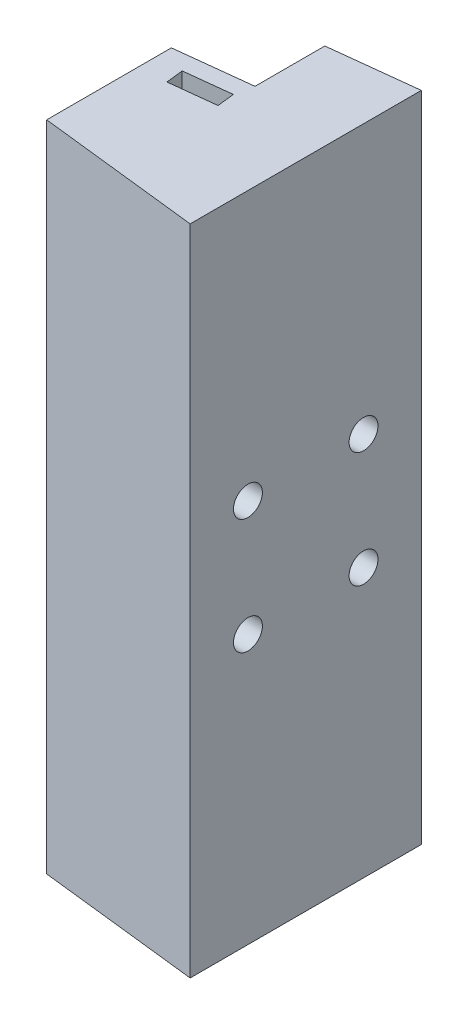
ISO-10303-21;
HEADER;
FILE_DESCRIPTION(('STEP AP214'),'2;1');
FILE_NAME('part.step','',(''),(''),'','','');
FILE_SCHEMA(('AUTOMOTIVE_DESIGN { 1 0 10303 214 1 1 1 1 }'));
ENDSEC;
DATA;
#1=APPLICATION_CONTEXT('core data for automotive mechanical design processes');
#2=APPLICATION_PROTOCOL_DEFINITION('international standard','automotive_design',2000,#1);
#3=PRODUCT_CONTEXT('',#1,'mechanical');
#4=PRODUCT('Part','Part','',(#3));
#5=PRODUCT_RELATED_PRODUCT_CATEGORY('part','',(#4));
#6=PRODUCT_DEFINITION_FORMATION('','',#4);
#7=PRODUCT_DEFINITION_CONTEXT('part definition',#1,'design');
#8=PRODUCT_DEFINITION('design','',#6,#7);
#9=PRODUCT_DEFINITION_SHAPE('','',#8);
#10=(LENGTH_UNIT() NAMED_UNIT(*) SI_UNIT(.MILLI.,.METRE.));
#11=(NAMED_UNIT(*) PLANE_ANGLE_UNIT() SI_UNIT($,.RADIAN.));
#12=(NAMED_UNIT(*) SI_UNIT($,.STERADIAN.) SOLID_ANGLE_UNIT());
#13=UNCERTAINTY_MEASURE_WITH_UNIT(LENGTH_MEASURE(1.E-05),#10,'distance_accuracy_value','');
#14=(GEOMETRIC_REPRESENTATION_CONTEXT(3) GLOBAL_UNCERTAINTY_ASSIGNED_CONTEXT((#13)) GLOBAL_UNIT_ASSIGNED_CONTEXT((#10,
#11,#12)) REPRESENTATION_CONTEXT('',''));
#15=CARTESIAN_POINT('',(0.,0.,0.));
#16=DIRECTION('',(0.,0.,1.));
#17=DIRECTION('',(1.,0.,0.));
#18=AXIS2_PLACEMENT_3D('',#15,#16,#17);
#19=CARTESIAN_POINT('',(-20.,10.,10.));
#20=DIRECTION('',(1.,0.,0.));
#21=DIRECTION('',(0.,0.,-1.));
#22=AXIS2_PLACEMENT_3D('',#19,#20,#21);
#23=CYLINDRICAL_SURFACE('',#22,2.5);
#24=CARTESIAN_POINT('',(0.,10.,10.));
#25=DIRECTION('',(1.,0.,0.));
#26=DIRECTION('',(0.,0.,-1.));
#27=AXIS2_PLACEMENT_3D('',#24,#25,#26);
#28=CIRCLE('',#27,2.5);
#29=CARTESIAN_POINT('',(0.,10.,7.5));
#30=VERTEX_POINT('',#29);
#31=EDGE_CURVE('E268',#30,#30,#28,.T.);
#32=ORIENTED_EDGE('',*,*,#31,.T.);
#33=EDGE_LOOP('',(#32));
#34=FACE_BOUND('',#33,.T.);
#35=CARTESIAN_POINT('',(-6.,10.,10.));
#36=DIRECTION('',(-1.,0.,0.));
#37=DIRECTION('',(0.,0.,1.));
#38=AXIS2_PLACEMENT_3D('',#35,#36,#37);
#39=CIRCLE('',#38,2.5);
#40=CARTESIAN_POINT('',(-6.,10.,12.5));
#41=VERTEX_POINT('',#40);
#42=EDGE_CURVE('E264',#41,#41,#39,.F.);
#43=ORIENTED_EDGE('',*,*,#42,.F.);
#44=EDGE_LOOP('',(#43));
#45=FACE_BOUND('',#44,.T.);
#46=ADVANCED_FACE('F35',(#34,#45),#23,.F.);
#47=CARTESIAN_POINT('',(-20.,-10.,30.));
#48=DIRECTION('',(1.,0.,0.));
#49=DIRECTION('',(0.,0.,-1.));
#50=AXIS2_PLACEMENT_3D('',#47,#48,#49);
#51=CYLINDRICAL_SURFACE('',#50,2.5);
#52=CARTESIAN_POINT('',(0.,-10.,30.));
#53=DIRECTION('',(1.,0.,0.));
#54=DIRECTION('',(0.,0.,-1.));
#55=AXIS2_PLACEMENT_3D('',#52,#53,#54);
#56=CIRCLE('',#55,2.5);
#57=CARTESIAN_POINT('',(0.,-10.,27.5));
#58=VERTEX_POINT('',#57);
#59=EDGE_CURVE('E260',#58,#58,#56,.T.);
#60=ORIENTED_EDGE('',*,*,#59,.T.);
#61=EDGE_LOOP('',(#60));
#62=FACE_BOUND('',#61,.T.);
#63=CARTESIAN_POINT('',(-6.,-10.,30.));
#64=DIRECTION('',(-1.,0.,0.));
#65=DIRECTION('',(0.,0.,1.));
#66=AXIS2_PLACEMENT_3D('',#63,#64,#65);
#67=CIRCLE('',#66,2.5);
#68=CARTESIAN_POINT('',(-6.,-10.,32.5));
#69=VERTEX_POINT('',#68);
#70=EDGE_CURVE('E307',#69,#69,#67,.F.);
#71=ORIENTED_EDGE('',*,*,#70,.F.);
#72=EDGE_LOOP('',(#71));
#73=FACE_BOUND('',#72,.T.);
#74=ADVANCED_FACE('F363',(#62,#73),#51,.F.);
#75=CARTESIAN_POINT('',(-20.,9.99999999999999,30.));
#76=DIRECTION('',(1.,0.,0.));
#77=DIRECTION('',(0.,0.,-1.));
#78=AXIS2_PLACEMENT_3D('',#75,#76,#77);
#79=CYLINDRICAL_SURFACE('',#78,2.5);
#80=CARTESIAN_POINT('',(0.,9.99999999999999,30.));
#81=DIRECTION('',(1.,0.,0.));
#82=DIRECTION('',(0.,0.,-1.));
#83=AXIS2_PLACEMENT_3D('',#80,#81,#82);
#84=CIRCLE('',#83,2.5);
#85=CARTESIAN_POINT('',(0.,9.99999999999999,27.5));
#86=VERTEX_POINT('',#85);
#87=EDGE_CURVE('E263',#86,#86,#84,.T.);
#88=ORIENTED_EDGE('',*,*,#87,.T.);
#89=EDGE_LOOP('',(#88));
#90=FACE_BOUND('',#89,.T.);
#91=CARTESIAN_POINT('',(-6.,9.99999999999999,30.));
#92=DIRECTION('',(-1.,0.,0.));
#93=DIRECTION('',(0.,0.,1.));
#94=AXIS2_PLACEMENT_3D('',#91,#92,#93);
#95=CIRCLE('',#94,2.5);
#96=CARTESIAN_POINT('',(-6.,9.99999999999999,32.5));
#97=VERTEX_POINT('',#96);
#98=EDGE_CURVE('E304',#97,#97,#95,.F.);
#99=ORIENTED_EDGE('',*,*,#98,.F.);
#100=EDGE_LOOP('',(#99));
#101=FACE_BOUND('',#100,.T.);
#102=ADVANCED_FACE('F369',(#90,#101),#79,.F.);
#103=CARTESIAN_POINT('',(-20.,-10.,10.));
#104=DIRECTION('',(1.,0.,0.));
#105=DIRECTION('',(0.,0.,-1.));
#106=AXIS2_PLACEMENT_3D('',#103,#104,#105);
#107=CYLINDRICAL_SURFACE('',#106,2.5);
#108=CARTESIAN_POINT('',(0.,-10.,10.));
#109=DIRECTION('',(1.,0.,0.));
#110=DIRECTION('',(0.,0.,-1.));
#111=AXIS2_PLACEMENT_3D('',#108,#109,#110);
#112=CIRCLE('',#111,2.5);
#113=CARTESIAN_POINT('',(0.,-10.,7.5));
#114=VERTEX_POINT('',#113);
#115=EDGE_CURVE('E265',#114,#114,#112,.T.);
#116=ORIENTED_EDGE('',*,*,#115,.T.);
#117=EDGE_LOOP('',(#116));
#118=FACE_BOUND('',#117,.T.);
#119=CARTESIAN_POINT('',(-6.,-10.,10.));
#120=DIRECTION('',(-1.,0.,0.));
#121=DIRECTION('',(0.,0.,1.));
#122=AXIS2_PLACEMENT_3D('',#119,#120,#121);
#123=CIRCLE('',#122,2.5);
#124=CARTESIAN_POINT('',(-6.,-10.,12.5));
#125=VERTEX_POINT('',#124);
#126=EDGE_CURVE('E257',#125,#125,#123,.F.);
#127=ORIENTED_EDGE('',*,*,#126,.F.);
#128=EDGE_LOOP('',(#127));
#129=FACE_BOUND('',#128,.T.);
#130=ADVANCED_FACE('F360',(#118,#129),#107,.F.);
#131=CARTESIAN_POINT('',(0.,56.5,40.));
#132=DIRECTION('',(-1.,0.,0.));
#133=DIRECTION('',(0.,0.,1.));
#134=AXIS2_PLACEMENT_3D('',#131,#132,#133);
#135=PLANE('',#134);
#136=ORIENTED_EDGE('',*,*,#115,.F.);
#137=EDGE_LOOP('',(#136));
#138=FACE_BOUND('',#137,.T.);
#139=ORIENTED_EDGE('',*,*,#87,.F.);
#140=EDGE_LOOP('',(#139));
#141=FACE_BOUND('',#140,.T.);
#142=ORIENTED_EDGE('',*,*,#59,.F.);
#143=EDGE_LOOP('',(#142));
#144=FACE_BOUND('',#143,.T.);
#145=ORIENTED_EDGE('',*,*,#31,.F.);
#146=EDGE_LOOP('',(#145));
#147=FACE_BOUND('',#146,.T.);
#148=DIRECTION('',(0.,0.,-1.));
#149=VECTOR('',#148,1.);
#150=CARTESIAN_POINT('',(0.,-56.5,40.));
#151=LINE('',#150,#149);
#152=CARTESIAN_POINT('',(0.,-56.5,40.));
#153=VERTEX_POINT('',#152);
#154=CARTESIAN_POINT('',(0.,-56.5,0.));
#155=VERTEX_POINT('',#154);
#156=EDGE_CURVE('E273',#153,#155,#151,.T.);
#157=ORIENTED_EDGE('',*,*,#156,.T.);
#158=DIRECTION('',(0.,-1.,0.));
#159=VECTOR('',#158,1.);
#160=CARTESIAN_POINT('',(0.,56.5,0.));
#161=LINE('',#160,#159);
#162=CARTESIAN_POINT('',(0.,56.5,0.));
#163=VERTEX_POINT('',#162);
#164=EDGE_CURVE('E299',#163,#155,#161,.T.);
#165=ORIENTED_EDGE('',*,*,#164,.F.);
#166=DIRECTION('',(0.,0.,-1.));
#167=VECTOR('',#166,1.);
#168=CARTESIAN_POINT('',(0.,56.5,40.));
#169=LINE('',#168,#167);
#170=CARTESIAN_POINT('',(0.,56.5,40.));
#171=VERTEX_POINT('',#170);
#172=EDGE_CURVE('E274',#171,#163,#169,.T.);
#173=ORIENTED_EDGE('',*,*,#172,.F.);
#174=DIRECTION('',(0.,-1.,0.));
#175=VECTOR('',#174,1.);
#176=CARTESIAN_POINT('',(0.,56.5,40.));
#177=LINE('',#176,#175);
#178=EDGE_CURVE('E285',#171,#153,#177,.T.);
#179=ORIENTED_EDGE('',*,*,#178,.T.);
#180=EDGE_LOOP('',(#157,#165,#173,#179));
#181=FACE_BOUND('',#180,.T.);
#182=ADVANCED_FACE('F37',(#138,#141,#144,#147,#181),#135,.F.);
#183=CARTESIAN_POINT('',(0.,56.5,0.));
#184=DIRECTION('',(0.112682965266922,0.,0.993630992541322));
#185=DIRECTION('',(0.993630992541322,0.,-0.112682965266922));
#186=AXIS2_PLACEMENT_3D('',#183,#184,#185);
#187=PLANE('',#186);
#188=DIRECTION('',(-0.993630992541322,0.,0.112682965266922));
#189=VECTOR('',#188,1.);
#190=CARTESIAN_POINT('',(0.,-56.5,0.));
#191=LINE('',#190,#189);
#192=CARTESIAN_POINT('',(-15.,-56.5,1.70107866168791));
#193=VERTEX_POINT('',#192);
#194=EDGE_CURVE('E288',#155,#193,#191,.T.);
#195=ORIENTED_EDGE('',*,*,#194,.T.);
#196=DIRECTION('',(0.,-1.,0.));
#197=VECTOR('',#196,1.);
#198=CARTESIAN_POINT('',(-15.,69.5000000000001,1.70107866168791));
#199=LINE('',#198,#197);
#200=CARTESIAN_POINT('',(-15.,56.5,1.70107866168791));
#201=VERTEX_POINT('',#200);
#202=EDGE_CURVE('E222',#201,#193,#199,.T.);
#203=ORIENTED_EDGE('',*,*,#202,.F.);
#204=DIRECTION('',(-0.993630992541322,0.,0.112682965266922));
#205=VECTOR('',#204,1.);
#206=CARTESIAN_POINT('',(0.,56.5,0.));
#207=LINE('',#206,#205);
#208=EDGE_CURVE('E277',#163,#201,#207,.T.);
#209=ORIENTED_EDGE('',*,*,#208,.F.);
#210=ORIENTED_EDGE('',*,*,#164,.T.);
#211=EDGE_LOOP('',(#195,#203,#209,#210));
#212=FACE_BOUND('',#211,.T.);
#213=ADVANCED_FACE('F352',(#212),#187,.F.);
#214=CARTESIAN_POINT('',(-28.,56.5,36.8246531648492));
#215=DIRECTION('',(1.,0.,0.));
#216=DIRECTION('',(0.,0.,-1.));
#217=AXIS2_PLACEMENT_3D('',#214,#215,#216);
#218=PLANE('',#217);
#219=CARTESIAN_POINT('',(-28.,-10.,30.));
#220=DIRECTION('',(-1.,0.,0.));
#221=DIRECTION('',(0.,0.,1.));
#222=AXIS2_PLACEMENT_3D('',#219,#220,#221);
#223=CIRCLE('',#222,5.);
#224=CARTESIAN_POINT('',(-28.,-10.,35.));
#225=VERTEX_POINT('',#224);
#226=EDGE_CURVE('E246',#225,#225,#223,.T.);
#227=ORIENTED_EDGE('',*,*,#226,.F.);
#228=EDGE_LOOP('',(#227));
#229=FACE_BOUND('',#228,.T.);
#230=CARTESIAN_POINT('',(-28.,9.99999999999999,30.));
#231=DIRECTION('',(-1.,0.,0.));
#232=DIRECTION('',(0.,0.,1.));
#233=AXIS2_PLACEMENT_3D('',#230,#231,#232);
#234=CIRCLE('',#233,5.);
#235=CARTESIAN_POINT('',(-28.,9.99999999999999,35.));
#236=VERTEX_POINT('',#235);
#237=EDGE_CURVE('E245',#236,#236,#234,.T.);
#238=ORIENTED_EDGE('',*,*,#237,.F.);
#239=EDGE_LOOP('',(#238));
#240=FACE_BOUND('',#239,.T.);
#241=DIRECTION('',(0.,0.,1.));
#242=VECTOR('',#241,1.);
#243=CARTESIAN_POINT('',(-28.,56.5,36.8246531648492));
#244=LINE('',#243,#242);
#245=CARTESIAN_POINT('',(-28.,56.5,15.2522648158477));
#246=VERTEX_POINT('',#245);
#247=CARTESIAN_POINT('',(-28.,56.5,36.8246531648492));
#248=VERTEX_POINT('',#247);
#249=EDGE_CURVE('E281',#246,#248,#244,.T.);
#250=ORIENTED_EDGE('',*,*,#249,.F.);
#251=DIRECTION('',(0.,-1.,0.));
#252=VECTOR('',#251,1.);
#253=CARTESIAN_POINT('',(-28.,69.5000000000001,15.2522648158477));
#254=LINE('',#253,#252);
#255=CARTESIAN_POINT('',(-28.,-56.5,15.2522648158477));
#256=VERTEX_POINT('',#255);
#257=EDGE_CURVE('E223',#246,#256,#254,.T.);
#258=ORIENTED_EDGE('',*,*,#257,.T.);
#259=DIRECTION('',(0.,0.,1.));
#260=VECTOR('',#259,1.);
#261=CARTESIAN_POINT('',(-28.,-56.5,36.8246531648492));
#262=LINE('',#261,#260);
#263=CARTESIAN_POINT('',(-28.,-56.5,36.8246531648492));
#264=VERTEX_POINT('',#263);
#265=EDGE_CURVE('E291',#256,#264,#262,.T.);
#266=ORIENTED_EDGE('',*,*,#265,.T.);
#267=DIRECTION('',(0.,-1.,0.));
#268=VECTOR('',#267,1.);
#269=CARTESIAN_POINT('',(-28.,56.5,36.8246531648492));
#270=LINE('',#269,#268);
#271=EDGE_CURVE('E296',#248,#264,#270,.T.);
#272=ORIENTED_EDGE('',*,*,#271,.F.);
#273=EDGE_LOOP('',(#250,#258,#266,#272));
#274=FACE_BOUND('',#273,.T.);
#275=ADVANCED_FACE('F336',(#229,#240,#274),#218,.F.);
#276=CARTESIAN_POINT('',(0.,56.5,40.));
#277=DIRECTION('',(0.112682965266921,0.,-0.993630992541322));
#278=DIRECTION('',(-0.993630992541323,0.,-0.112682965266921));
#279=AXIS2_PLACEMENT_3D('',#276,#277,#278);
#280=PLANE('',#279);
#281=DIRECTION('',(0.993630992541322,0.,0.112682965266921));
#282=VECTOR('',#281,1.);
#283=CARTESIAN_POINT('',(0.,-56.5,40.));
#284=LINE('',#283,#282);
#285=EDGE_CURVE('E278',#264,#153,#284,.T.);
#286=ORIENTED_EDGE('',*,*,#285,.T.);
#287=ORIENTED_EDGE('',*,*,#178,.F.);
#288=DIRECTION('',(0.993630992541322,0.,0.112682965266921));
#289=VECTOR('',#288,1.);
#290=CARTESIAN_POINT('',(0.,56.5,40.));
#291=LINE('',#290,#289);
#292=EDGE_CURVE('E283',#248,#171,#291,.T.);
#293=ORIENTED_EDGE('',*,*,#292,.F.);
#294=ORIENTED_EDGE('',*,*,#271,.T.);
#295=EDGE_LOOP('',(#286,#287,#293,#294));
#296=FACE_BOUND('',#295,.T.);
#297=ADVANCED_FACE('F343',(#296),#280,.F.);
#298=CARTESIAN_POINT('',(0.,56.5,0.));
#299=DIRECTION('',(0.,1.,0.));
#300=DIRECTION('',(0.,0.,1.));
#301=AXIS2_PLACEMENT_3D('',#298,#299,#300);
#302=PLANE('',#301);
#303=DIRECTION('',(0.993630992541323,0.,-0.112682965266921));
#304=VECTOR('',#303,1.);
#305=CARTESIAN_POINT('',(-15.6555820967406,56.5,16.8715725852757));
#306=LINE('',#305,#304);
#307=CARTESIAN_POINT('',(-23.6046300370711,56.5,17.7730363074111));
#308=VERTEX_POINT('',#307);
#309=CARTESIAN_POINT('',(-15.6555820967406,56.5,16.8715725852757));
#310=VERTEX_POINT('',#309);
#311=EDGE_CURVE('E181',#308,#310,#306,.T.);
#312=ORIENTED_EDGE('',*,*,#311,.T.);
#313=DIRECTION('',(0.112682965266921,0.,0.993630992541323));
#314=VECTOR('',#313,1.);
#315=CARTESIAN_POINT('',(-15.6555820967406,56.5,16.8715725852757));
#316=LINE('',#315,#314);
#317=CARTESIAN_POINT('',(-15.3175332009398,56.5,19.8524655628997));
#318=VERTEX_POINT('',#317);
#319=EDGE_CURVE('E207',#310,#318,#316,.T.);
#320=ORIENTED_EDGE('',*,*,#319,.T.);
#321=DIRECTION('',(0.993630992541323,0.,-0.112682965266921));
#322=VECTOR('',#321,1.);
#323=CARTESIAN_POINT('',(-15.3175332009398,56.5,19.8524655628997));
#324=LINE('',#323,#322);
#325=CARTESIAN_POINT('',(-23.2665811412704,56.5,20.753929285035));
#326=VERTEX_POINT('',#325);
#327=EDGE_CURVE('E191',#326,#318,#324,.T.);
#328=ORIENTED_EDGE('',*,*,#327,.F.);
#329=DIRECTION('',(0.112682965266921,0.,0.993630992541323));
#330=VECTOR('',#329,1.);
#331=CARTESIAN_POINT('',(-23.6046300370711,56.5,17.7730363074111));
#332=LINE('',#331,#330);
#333=EDGE_CURVE('E52',#308,#326,#332,.T.);
#334=ORIENTED_EDGE('',*,*,#333,.F.);
#335=EDGE_LOOP('',(#312,#320,#328,#334));
#336=FACE_BOUND('',#335,.T.);
#337=DIRECTION('',(0.993630992541323,0.,-0.112682965266921));
#338=VECTOR('',#337,1.);
#339=CARTESIAN_POINT('',(1.35219558320306,56.5,11.9235719104959));
#340=LINE('',#339,#338);
#341=CARTESIAN_POINT('',(-15.,56.5,13.7779966423848));
#342=VERTEX_POINT('',#341);
#343=EDGE_CURVE('E239',#246,#342,#340,.T.);
#344=ORIENTED_EDGE('',*,*,#343,.F.);
#345=ORIENTED_EDGE('',*,*,#249,.T.);
#346=ORIENTED_EDGE('',*,*,#292,.T.);
#347=ORIENTED_EDGE('',*,*,#172,.T.);
#348=ORIENTED_EDGE('',*,*,#208,.T.);
#349=DIRECTION('',(0.,0.,-1.));
#350=VECTOR('',#349,1.);
#351=CARTESIAN_POINT('',(-15.,56.5,0.));
#352=LINE('',#351,#350);
#353=EDGE_CURVE('E234',#342,#201,#352,.T.);
#354=ORIENTED_EDGE('',*,*,#353,.F.);
#355=EDGE_LOOP('',(#344,#345,#346,#347,#348,#354));
#356=FACE_BOUND('',#355,.T.);
#357=ADVANCED_FACE('F349',(#336,#356),#302,.T.);
#358=CARTESIAN_POINT('',(0.,-56.5,0.));
#359=DIRECTION('',(0.,1.,0.));
#360=DIRECTION('',(0.,0.,1.));
#361=AXIS2_PLACEMENT_3D('',#358,#359,#360);
#362=PLANE('',#361);
#363=DIRECTION('',(0.112682965266921,0.,0.993630992541323));
#364=VECTOR('',#363,1.);
#365=CARTESIAN_POINT('',(-15.6555820967406,-56.5,16.8715725852757));
#366=LINE('',#365,#364);
#367=CARTESIAN_POINT('',(-15.6555820967406,-56.5,16.8715725852757));
#368=VERTEX_POINT('',#367);
#369=CARTESIAN_POINT('',(-15.3175332009398,-56.5,19.8524655628997));
#370=VERTEX_POINT('',#369);
#371=EDGE_CURVE('E60',#368,#370,#366,.T.);
#372=ORIENTED_EDGE('',*,*,#371,.F.);
#373=DIRECTION('',(-0.993630992541323,0.,0.112682965266921));
#374=VECTOR('',#373,1.);
#375=CARTESIAN_POINT('',(-15.6555820967406,-56.5,16.8715725852757));
#376=LINE('',#375,#374);
#377=CARTESIAN_POINT('',(-23.6046300370711,-56.5,17.7730363074111));
#378=VERTEX_POINT('',#377);
#379=EDGE_CURVE('E158',#368,#378,#376,.T.);
#380=ORIENTED_EDGE('',*,*,#379,.T.);
#381=DIRECTION('',(0.112682965266921,0.,0.993630992541323));
#382=VECTOR('',#381,1.);
#383=CARTESIAN_POINT('',(-23.6046300370711,-56.5,17.7730363074111));
#384=LINE('',#383,#382);
#385=CARTESIAN_POINT('',(-23.2665811412704,-56.5,20.753929285035));
#386=VERTEX_POINT('',#385);
#387=EDGE_CURVE('E177',#378,#386,#384,.T.);
#388=ORIENTED_EDGE('',*,*,#387,.T.);
#389=DIRECTION('',(-0.993630992541323,0.,0.112682965266921));
#390=VECTOR('',#389,1.);
#391=CARTESIAN_POINT('',(-15.3175332009398,-56.5,19.8524655628997));
#392=LINE('',#391,#390);
#393=EDGE_CURVE('E728',#370,#386,#392,.T.);
#394=ORIENTED_EDGE('',*,*,#393,.F.);
#395=EDGE_LOOP('',(#372,#380,#388,#394));
#396=FACE_BOUND('',#395,.T.);
#397=ORIENTED_EDGE('',*,*,#265,.F.);
#398=DIRECTION('',(-0.993630992541322,0.,0.112682965266921));
#399=VECTOR('',#398,1.);
#400=CARTESIAN_POINT('',(-15.,-56.5,13.7779966423848));
#401=LINE('',#400,#399);
#402=CARTESIAN_POINT('',(-15.,-56.5,13.7779966423848));
#403=VERTEX_POINT('',#402);
#404=EDGE_CURVE('E220',#403,#256,#401,.T.);
#405=ORIENTED_EDGE('',*,*,#404,.F.);
#406=DIRECTION('',(0.,0.,1.));
#407=VECTOR('',#406,1.);
#408=CARTESIAN_POINT('',(-15.,-56.5,1.70107866168791));
#409=LINE('',#408,#407);
#410=EDGE_CURVE('E214',#193,#403,#409,.T.);
#411=ORIENTED_EDGE('',*,*,#410,.F.);
#412=ORIENTED_EDGE('',*,*,#194,.F.);
#413=ORIENTED_EDGE('',*,*,#156,.F.);
#414=ORIENTED_EDGE('',*,*,#285,.F.);
#415=EDGE_LOOP('',(#397,#405,#411,#412,#413,#414));
#416=FACE_BOUND('',#415,.T.);
#417=ADVANCED_FACE('F339',(#396,#416),#362,.F.);
#418=CARTESIAN_POINT('',(-6.,-10.,10.));
#419=DIRECTION('',(-1.,0.,0.));
#420=DIRECTION('',(0.,0.,1.));
#421=AXIS2_PLACEMENT_3D('',#418,#419,#420);
#422=PLANE('',#421);
#423=CARTESIAN_POINT('',(-6.,-10.,10.));
#424=DIRECTION('',(-1.,0.,0.));
#425=DIRECTION('',(0.,0.,1.));
#426=AXIS2_PLACEMENT_3D('',#423,#424,#425);
#427=CIRCLE('',#426,5.);
#428=CARTESIAN_POINT('',(-6.,-10.,15.));
#429=VERTEX_POINT('',#428);
#430=EDGE_CURVE('E249',#429,#429,#427,.T.);
#431=ORIENTED_EDGE('',*,*,#430,.T.);
#432=EDGE_LOOP('',(#431));
#433=FACE_BOUND('',#432,.T.);
#434=ORIENTED_EDGE('',*,*,#126,.T.);
#435=EDGE_LOOP('',(#434));
#436=FACE_BOUND('',#435,.T.);
#437=ADVANCED_FACE('F381',(#433,#436),#422,.T.);
#438=CARTESIAN_POINT('',(-6.,-10.,10.));
#439=DIRECTION('',(-1.,0.,0.));
#440=DIRECTION('',(0.,0.,1.));
#441=AXIS2_PLACEMENT_3D('',#438,#439,#440);
#442=CYLINDRICAL_SURFACE('',#441,5.);
#443=CARTESIAN_POINT('',(-15.,-10.,10.));
#444=DIRECTION('',(1.,0.,0.));
#445=DIRECTION('',(0.,0.,-1.));
#446=AXIS2_PLACEMENT_3D('',#443,#444,#445);
#447=CIRCLE('',#446,5.);
#448=CARTESIAN_POINT('',(-15.,-6.72482956624711,13.7779966423848));
#449=VERTEX_POINT('',#448);
#450=CARTESIAN_POINT('',(-15.,-13.2751704337529,13.7779966423848));
#451=VERTEX_POINT('',#450);
#452=EDGE_CURVE('E226',#449,#451,#447,.F.);
#453=ORIENTED_EDGE('',*,*,#452,.T.);
#454=CARTESIAN_POINT('',(18.3141264493559,-10.,10.));
#455=DIRECTION('',(0.112682965266921,0.,0.993630992541322));
#456=DIRECTION('',(-0.993630992541323,0.,0.112682965266921));
#457=AXIS2_PLACEMENT_3D('',#454,#455,#456);
#458=ELLIPSE('',#457,44.3722792363166,5.);
#459=EDGE_CURVE('E236',#451,#449,#458,.F.);
#460=ORIENTED_EDGE('',*,*,#459,.T.);
#461=EDGE_LOOP('',(#453,#460));
#462=FACE_BOUND('',#461,.T.);
#463=ORIENTED_EDGE('',*,*,#430,.F.);
#464=EDGE_LOOP('',(#463));
#465=FACE_BOUND('',#464,.T.);
#466=ADVANCED_FACE('F328',(#462,#465),#442,.F.);
#467=CARTESIAN_POINT('',(-6.,9.99999999999999,30.));
#468=DIRECTION('',(-1.,0.,0.));
#469=DIRECTION('',(0.,0.,1.));
#470=AXIS2_PLACEMENT_3D('',#467,#468,#469);
#471=PLANE('',#470);
#472=CARTESIAN_POINT('',(-6.,9.99999999999999,30.));
#473=DIRECTION('',(-1.,0.,0.));
#474=DIRECTION('',(0.,0.,1.));
#475=AXIS2_PLACEMENT_3D('',#472,#473,#474);
#476=CIRCLE('',#475,5.);
#477=CARTESIAN_POINT('',(-6.,9.99999999999999,35.));
#478=VERTEX_POINT('',#477);
#479=EDGE_CURVE('E254',#478,#478,#476,.T.);
#480=ORIENTED_EDGE('',*,*,#479,.T.);
#481=EDGE_LOOP('',(#480));
#482=FACE_BOUND('',#481,.T.);
#483=ORIENTED_EDGE('',*,*,#98,.T.);
#484=EDGE_LOOP('',(#483));
#485=FACE_BOUND('',#484,.T.);
#486=ADVANCED_FACE('F414',(#482,#485),#471,.T.);
#487=CARTESIAN_POINT('',(-6.,9.99999999999999,30.));
#488=DIRECTION('',(-1.,0.,0.));
#489=DIRECTION('',(0.,0.,1.));
#490=AXIS2_PLACEMENT_3D('',#487,#488,#489);
#491=CYLINDRICAL_SURFACE('',#490,5.);
#492=ORIENTED_EDGE('',*,*,#479,.F.);
#493=EDGE_LOOP('',(#492));
#494=FACE_BOUND('',#493,.T.);
#495=ORIENTED_EDGE('',*,*,#237,.T.);
#496=EDGE_LOOP('',(#495));
#497=FACE_BOUND('',#496,.T.);
#498=ADVANCED_FACE('F421',(#494,#497),#491,.F.);
#499=CARTESIAN_POINT('',(-6.,-10.,30.));
#500=DIRECTION('',(-1.,0.,0.));
#501=DIRECTION('',(0.,0.,1.));
#502=AXIS2_PLACEMENT_3D('',#499,#500,#501);
#503=PLANE('',#502);
#504=CARTESIAN_POINT('',(-6.,-10.,30.));
#505=DIRECTION('',(-1.,0.,0.));
#506=DIRECTION('',(0.,0.,1.));
#507=AXIS2_PLACEMENT_3D('',#504,#505,#506);
#508=CIRCLE('',#507,5.);
#509=CARTESIAN_POINT('',(-6.,-10.,35.));
#510=VERTEX_POINT('',#509);
#511=EDGE_CURVE('E242',#510,#510,#508,.T.);
#512=ORIENTED_EDGE('',*,*,#511,.T.);
#513=EDGE_LOOP('',(#512));
#514=FACE_BOUND('',#513,.T.);
#515=ORIENTED_EDGE('',*,*,#70,.T.);
#516=EDGE_LOOP('',(#515));
#517=FACE_BOUND('',#516,.T.);
#518=ADVANCED_FACE('F429',(#514,#517),#503,.T.);
#519=CARTESIAN_POINT('',(-6.,-10.,30.));
#520=DIRECTION('',(-1.,0.,0.));
#521=DIRECTION('',(0.,0.,1.));
#522=AXIS2_PLACEMENT_3D('',#519,#520,#521);
#523=CYLINDRICAL_SURFACE('',#522,5.);
#524=ORIENTED_EDGE('',*,*,#511,.F.);
#525=EDGE_LOOP('',(#524));
#526=FACE_BOUND('',#525,.T.);
#527=ORIENTED_EDGE('',*,*,#226,.T.);
#528=EDGE_LOOP('',(#527));
#529=FACE_BOUND('',#528,.T.);
#530=ADVANCED_FACE('F437',(#526,#529),#523,.F.);
#531=CARTESIAN_POINT('',(-6.,10.,10.));
#532=DIRECTION('',(-1.,0.,0.));
#533=DIRECTION('',(0.,0.,1.));
#534=AXIS2_PLACEMENT_3D('',#531,#532,#533);
#535=PLANE('',#534);
#536=CARTESIAN_POINT('',(-6.,10.,10.));
#537=DIRECTION('',(-1.,0.,0.));
#538=DIRECTION('',(0.,0.,1.));
#539=AXIS2_PLACEMENT_3D('',#536,#537,#538);
#540=CIRCLE('',#539,5.);
#541=CARTESIAN_POINT('',(-6.,10.,15.));
#542=VERTEX_POINT('',#541);
#543=EDGE_CURVE('E241',#542,#542,#540,.T.);
#544=ORIENTED_EDGE('',*,*,#543,.T.);
#545=EDGE_LOOP('',(#544));
#546=FACE_BOUND('',#545,.T.);
#547=ORIENTED_EDGE('',*,*,#42,.T.);
#548=EDGE_LOOP('',(#547));
#549=FACE_BOUND('',#548,.T.);
#550=ADVANCED_FACE('F445',(#546,#549),#535,.T.);
#551=CARTESIAN_POINT('',(-6.,10.,10.));
#552=DIRECTION('',(-1.,0.,0.));
#553=DIRECTION('',(0.,0.,1.));
#554=AXIS2_PLACEMENT_3D('',#551,#552,#553);
#555=CYLINDRICAL_SURFACE('',#554,5.);
#556=CARTESIAN_POINT('',(-15.,10.,10.));
#557=DIRECTION('',(1.,0.,0.));
#558=DIRECTION('',(0.,0.,-1.));
#559=AXIS2_PLACEMENT_3D('',#556,#557,#558);
#560=CIRCLE('',#559,5.);
#561=CARTESIAN_POINT('',(-15.,13.2751704337529,13.7779966423848));
#562=VERTEX_POINT('',#561);
#563=CARTESIAN_POINT('',(-15.,6.7248295662471,13.7779966423848));
#564=VERTEX_POINT('',#563);
#565=EDGE_CURVE('E44',#562,#564,#560,.F.);
#566=ORIENTED_EDGE('',*,*,#565,.T.);
#567=CARTESIAN_POINT('',(18.3141264493559,10.,10.));
#568=DIRECTION('',(0.112682965266921,0.,0.993630992541322));
#569=DIRECTION('',(-0.993630992541323,0.,0.112682965266921));
#570=AXIS2_PLACEMENT_3D('',#567,#568,#569);
#571=ELLIPSE('',#570,44.3722792363166,5.);
#572=EDGE_CURVE('E11',#564,#562,#571,.F.);
#573=ORIENTED_EDGE('',*,*,#572,.T.);
#574=EDGE_LOOP('',(#566,#573));
#575=FACE_BOUND('',#574,.T.);
#576=ORIENTED_EDGE('',*,*,#543,.F.);
#577=EDGE_LOOP('',(#576));
#578=FACE_BOUND('',#577,.T.);
#579=ADVANCED_FACE('F314',(#575,#578),#555,.F.);
#580=CARTESIAN_POINT('',(-15.,69.5000000000001,13.7779966423848));
#581=DIRECTION('',(0.112682965266921,0.,0.993630992541322));
#582=DIRECTION('',(0.993630992541323,0.,-0.112682965266921));
#583=AXIS2_PLACEMENT_3D('',#580,#581,#582);
#584=PLANE('',#583);
#585=CARTESIAN_POINT('',(-19.9681549627066,-51.5,14.3414114687194));
#586=DIRECTION('',(-0.112682965266921,0.,-0.993630992541323));
#587=DIRECTION('',(-0.993630992541323,0.,0.112682965266921));
#588=AXIS2_PLACEMENT_3D('',#585,#586,#587);
#589=CIRCLE('',#588,2.00000000000001);
#590=CARTESIAN_POINT('',(-21.9554169477893,-51.5,14.5667773992533));
#591=VERTEX_POINT('',#590);
#592=EDGE_CURVE('E211',#591,#591,#589,.T.);
#593=ORIENTED_EDGE('',*,*,#592,.F.);
#594=EDGE_LOOP('',(#593));
#595=FACE_BOUND('',#594,.T.);
#596=CARTESIAN_POINT('',(-19.9681549627066,51.5,14.3414114687194));
#597=DIRECTION('',(-0.112682965266921,0.,-0.993630992541323));
#598=DIRECTION('',(-0.993630992541323,0.,0.112682965266921));
#599=AXIS2_PLACEMENT_3D('',#596,#597,#598);
#600=CIRCLE('',#599,2.00000000000001);
#601=CARTESIAN_POINT('',(-21.9554169477893,51.5,14.5667773992533));
#602=VERTEX_POINT('',#601);
#603=EDGE_CURVE('E215',#602,#602,#600,.T.);
#604=ORIENTED_EDGE('',*,*,#603,.F.);
#605=EDGE_LOOP('',(#604));
#606=FACE_BOUND('',#605,.T.);
#607=ORIENTED_EDGE('',*,*,#343,.T.);
#608=DIRECTION('',(0.,-1.,0.));
#609=VECTOR('',#608,1.);
#610=CARTESIAN_POINT('',(-15.,69.5000000000001,13.7779966423848));
#611=LINE('',#610,#609);
#612=EDGE_CURVE('E227',#342,#562,#611,.T.);
#613=ORIENTED_EDGE('',*,*,#612,.T.);
#614=ORIENTED_EDGE('',*,*,#572,.F.);
#615=EDGE_CURVE('E230',#564,#449,#611,.T.);
#616=ORIENTED_EDGE('',*,*,#615,.T.);
#617=ORIENTED_EDGE('',*,*,#459,.F.);
#618=EDGE_CURVE('E228',#451,#403,#611,.T.);
#619=ORIENTED_EDGE('',*,*,#618,.T.);
#620=ORIENTED_EDGE('',*,*,#404,.T.);
#621=ORIENTED_EDGE('',*,*,#257,.F.);
#622=EDGE_LOOP('',(#607,#613,#614,#616,#617,#619,#620,#621));
#623=FACE_BOUND('',#622,.T.);
#624=ADVANCED_FACE('F324',(#595,#606,#623),#584,.F.);
#625=CARTESIAN_POINT('',(-15.,69.5000000000001,1.70107866168791));
#626=DIRECTION('',(1.,0.,0.));
#627=DIRECTION('',(0.,0.,-1.));
#628=AXIS2_PLACEMENT_3D('',#625,#626,#627);
#629=PLANE('',#628);
#630=ORIENTED_EDGE('',*,*,#353,.T.);
#631=ORIENTED_EDGE('',*,*,#202,.T.);
#632=ORIENTED_EDGE('',*,*,#410,.T.);
#633=ORIENTED_EDGE('',*,*,#618,.F.);
#634=ORIENTED_EDGE('',*,*,#452,.F.);
#635=ORIENTED_EDGE('',*,*,#615,.F.);
#636=ORIENTED_EDGE('',*,*,#565,.F.);
#637=ORIENTED_EDGE('',*,*,#612,.F.);
#638=EDGE_LOOP('',(#630,#631,#632,#633,#634,#635,#636,#637));
#639=FACE_BOUND('',#638,.T.);
#640=ADVANCED_FACE('F320',(#639),#629,.F.);
#641=CARTESIAN_POINT('',(-19.2920571711051,51.5,20.3031974239674));
#642=DIRECTION('',(-0.112682965266921,0.,-0.993630992541323));
#643=DIRECTION('',(-0.993630992541322,0.,0.112682965266921));
#644=AXIS2_PLACEMENT_3D('',#641,#642,#643);
#645=CYLINDRICAL_SURFACE('',#644,2.00000000000001);
#646=CARTESIAN_POINT('',(-19.6301060669059,51.5,17.3223044463434));
#647=DIRECTION('',(-0.112682965266921,0.,-0.993630992541323));
#648=DIRECTION('',(-0.993630992541323,0.,0.112682965266921));
#649=AXIS2_PLACEMENT_3D('',#646,#647,#648);
#650=CIRCLE('',#649,2.00000000000001);
#651=CARTESIAN_POINT('',(-21.6173680519885,51.5,17.5476703768772));
#652=VERTEX_POINT('',#651);
#653=EDGE_CURVE('E39',#652,#652,#650,.F.);
#654=ORIENTED_EDGE('',*,*,#653,.T.);
#655=EDGE_LOOP('',(#654));
#656=FACE_BOUND('',#655,.T.);
#657=ORIENTED_EDGE('',*,*,#603,.T.);
#658=EDGE_LOOP('',(#657));
#659=FACE_BOUND('',#658,.T.);
#660=ADVANCED_FACE('F471',(#656,#659),#645,.F.);
#661=CARTESIAN_POINT('',(-19.2920571711051,-51.5,20.3031974239674));
#662=DIRECTION('',(-0.112682965266921,0.,-0.993630992541323));
#663=DIRECTION('',(-0.993630992541322,0.,0.112682965266921));
#664=AXIS2_PLACEMENT_3D('',#661,#662,#663);
#665=CYLINDRICAL_SURFACE('',#664,2.00000000000001);
#666=CARTESIAN_POINT('',(-19.6301060669059,-51.5,17.3223044463434));
#667=DIRECTION('',(-0.112682965266921,0.,-0.993630992541323));
#668=DIRECTION('',(-0.993630992541323,0.,0.112682965266921));
#669=AXIS2_PLACEMENT_3D('',#666,#667,#668);
#670=CIRCLE('',#669,2.00000000000001);
#671=CARTESIAN_POINT('',(-21.6173680519885,-51.5,17.5476703768772));
#672=VERTEX_POINT('',#671);
#673=EDGE_CURVE('E174',#672,#672,#670,.F.);
#674=ORIENTED_EDGE('',*,*,#673,.T.);
#675=EDGE_LOOP('',(#674));
#676=FACE_BOUND('',#675,.T.);
#677=ORIENTED_EDGE('',*,*,#592,.T.);
#678=EDGE_LOOP('',(#677));
#679=FACE_BOUND('',#678,.T.);
#680=ADVANCED_FACE('F477',(#676,#679),#665,.F.);
#681=CARTESIAN_POINT('',(-19.6301060669059,-51.5,17.3223044463434));
#682=DIRECTION('',(-0.112682965266921,0.,-0.993630992541323));
#683=DIRECTION('',(-0.993630992541323,0.,0.112682965266921));
#684=AXIS2_PLACEMENT_3D('',#681,#682,#683);
#685=PLANE('',#684);
#686=CARTESIAN_POINT('',(-19.6301060669059,-51.5,17.3223044463434));
#687=DIRECTION('',(-0.112682965266921,0.,-0.993630992541323));
#688=DIRECTION('',(-0.993630992541323,0.,0.112682965266921));
#689=AXIS2_PLACEMENT_3D('',#686,#687,#688);
#690=CIRCLE('',#689,4.);
#691=CARTESIAN_POINT('',(-23.6046300370711,-51.5,17.7730363074111));
#692=VERTEX_POINT('',#691);
#693=CARTESIAN_POINT('',(-15.6555820967406,-51.5,16.8715725852757));
#694=VERTEX_POINT('',#693);
#695=EDGE_CURVE('E156',#692,#694,#690,.T.);
#696=ORIENTED_EDGE('',*,*,#695,.F.);
#697=DIRECTION('',(0.,1.,0.));
#698=VECTOR('',#697,1.);
#699=CARTESIAN_POINT('',(-23.6046300370711,-56.5,17.7730363074111));
#700=LINE('',#699,#698);
#701=EDGE_CURVE('E724',#378,#692,#700,.T.);
#702=ORIENTED_EDGE('',*,*,#701,.F.);
#703=ORIENTED_EDGE('',*,*,#379,.F.);
#704=DIRECTION('',(0.,-1.,0.));
#705=VECTOR('',#704,1.);
#706=CARTESIAN_POINT('',(-15.6555820967406,-51.5,16.8715725852757));
#707=LINE('',#706,#705);
#708=EDGE_CURVE('E151',#694,#368,#707,.T.);
#709=ORIENTED_EDGE('',*,*,#708,.F.);
#710=EDGE_LOOP('',(#696,#702,#703,#709));
#711=FACE_BOUND('',#710,.T.);
#712=ORIENTED_EDGE('',*,*,#673,.F.);
#713=EDGE_LOOP('',(#712));
#714=FACE_BOUND('',#713,.T.);
#715=ADVANCED_FACE('F153',(#711,#714),#685,.F.);
#716=CARTESIAN_POINT('',(-19.6301060669059,-51.5,17.3223044463434));
#717=DIRECTION('',(0.112682965266921,0.,0.993630992541323));
#718=DIRECTION('',(0.993630992541322,0.,-0.112682965266921));
#719=AXIS2_PLACEMENT_3D('',#716,#717,#718);
#720=CYLINDRICAL_SURFACE('',#719,4.);
#721=CARTESIAN_POINT('',(-19.2920571711051,-51.5,20.3031974239674));
#722=DIRECTION('',(-0.112682965266921,0.,-0.993630992541323));
#723=DIRECTION('',(-0.993630992541323,0.,0.112682965266921));
#724=AXIS2_PLACEMENT_3D('',#721,#722,#723);
#725=CIRCLE('',#724,4.);
#726=CARTESIAN_POINT('',(-23.2665811412704,-51.5,20.753929285035));
#727=VERTEX_POINT('',#726);
#728=CARTESIAN_POINT('',(-15.3175332009398,-51.5,19.8524655628997));
#729=VERTEX_POINT('',#728);
#730=EDGE_CURVE('E210',#727,#729,#725,.T.);
#731=ORIENTED_EDGE('',*,*,#730,.F.);
#732=DIRECTION('',(0.112682965266921,0.,0.993630992541323));
#733=VECTOR('',#732,1.);
#734=CARTESIAN_POINT('',(-23.6046300370711,-51.5,17.7730363074111));
#735=LINE('',#734,#733);
#736=EDGE_CURVE('E169',#692,#727,#735,.T.);
#737=ORIENTED_EDGE('',*,*,#736,.F.);
#738=ORIENTED_EDGE('',*,*,#695,.T.);
#739=DIRECTION('',(0.112682965266921,0.,0.993630992541323));
#740=VECTOR('',#739,1.);
#741=CARTESIAN_POINT('',(-15.6555820967406,-51.5,16.8715725852757));
#742=LINE('',#741,#740);
#743=EDGE_CURVE('E166',#694,#729,#742,.T.);
#744=ORIENTED_EDGE('',*,*,#743,.T.);
#745=EDGE_LOOP('',(#731,#737,#738,#744));
#746=FACE_BOUND('',#745,.T.);
#747=ADVANCED_FACE('F165',(#746),#720,.F.);
#748=CARTESIAN_POINT('',(-15.6555820967406,-51.5,16.8715725852757));
#749=DIRECTION('',(-0.993630992541323,0.,0.112682965266921));
#750=DIRECTION('',(0.112682965266921,0.,0.993630992541322));
#751=AXIS2_PLACEMENT_3D('',#748,#749,#750);
#752=PLANE('',#751);
#753=DIRECTION('',(0.,-1.,0.));
#754=VECTOR('',#753,1.);
#755=CARTESIAN_POINT('',(-15.3175332009398,-51.5,19.8524655628997));
#756=LINE('',#755,#754);
#757=EDGE_CURVE('E173',#729,#370,#756,.T.);
#758=ORIENTED_EDGE('',*,*,#757,.F.);
#759=ORIENTED_EDGE('',*,*,#743,.F.);
#760=ORIENTED_EDGE('',*,*,#708,.T.);
#761=ORIENTED_EDGE('',*,*,#371,.T.);
#762=EDGE_LOOP('',(#758,#759,#760,#761));
#763=FACE_BOUND('',#762,.T.);
#764=ADVANCED_FACE('F172',(#763),#752,.T.);
#765=CARTESIAN_POINT('',(-23.6046300370711,-56.5,17.7730363074111));
#766=DIRECTION('',(0.993630992541323,0.,-0.112682965266921));
#767=DIRECTION('',(-0.112682965266921,0.,-0.993630992541322));
#768=AXIS2_PLACEMENT_3D('',#765,#766,#767);
#769=PLANE('',#768);
#770=DIRECTION('',(0.,1.,0.));
#771=VECTOR('',#770,1.);
#772=CARTESIAN_POINT('',(-23.2665811412704,-56.5,20.753929285035));
#773=LINE('',#772,#771);
#774=EDGE_CURVE('E170',#386,#727,#773,.T.);
#775=ORIENTED_EDGE('',*,*,#774,.F.);
#776=ORIENTED_EDGE('',*,*,#387,.F.);
#777=ORIENTED_EDGE('',*,*,#701,.T.);
#778=ORIENTED_EDGE('',*,*,#736,.T.);
#779=EDGE_LOOP('',(#775,#776,#777,#778));
#780=FACE_BOUND('',#779,.T.);
#781=ADVANCED_FACE('F504',(#780),#769,.T.);
#782=CARTESIAN_POINT('',(-19.6301060669059,51.5,17.3223044463434));
#783=DIRECTION('',(-0.112682965266921,0.,-0.993630992541323));
#784=DIRECTION('',(-0.993630992541323,0.,0.112682965266921));
#785=AXIS2_PLACEMENT_3D('',#782,#783,#784);
#786=PLANE('',#785);
#787=ORIENTED_EDGE('',*,*,#311,.F.);
#788=DIRECTION('',(0.,1.,0.));
#789=VECTOR('',#788,1.);
#790=CARTESIAN_POINT('',(-23.6046300370711,56.5,17.7730363074111));
#791=LINE('',#790,#789);
#792=CARTESIAN_POINT('',(-23.6046300370711,51.5,17.7730363074111));
#793=VERTEX_POINT('',#792);
#794=EDGE_CURVE('E189',#793,#308,#791,.T.);
#795=ORIENTED_EDGE('',*,*,#794,.F.);
#796=CARTESIAN_POINT('',(-19.6301060669059,51.5,17.3223044463434));
#797=DIRECTION('',(-0.112682965266921,0.,-0.993630992541323));
#798=DIRECTION('',(-0.993630992541323,0.,0.112682965266921));
#799=AXIS2_PLACEMENT_3D('',#796,#797,#798);
#800=CIRCLE('',#799,4.);
#801=CARTESIAN_POINT('',(-15.6555820967406,51.5,16.8715725852757));
#802=VERTEX_POINT('',#801);
#803=EDGE_CURVE('E187',#802,#793,#800,.T.);
#804=ORIENTED_EDGE('',*,*,#803,.F.);
#805=DIRECTION('',(0.,-1.,0.));
#806=VECTOR('',#805,1.);
#807=CARTESIAN_POINT('',(-15.6555820967406,56.5,16.8715725852757));
#808=LINE('',#807,#806);
#809=EDGE_CURVE('E184',#310,#802,#808,.T.);
#810=ORIENTED_EDGE('',*,*,#809,.F.);
#811=EDGE_LOOP('',(#787,#795,#804,#810));
#812=FACE_BOUND('',#811,.T.);
#813=ORIENTED_EDGE('',*,*,#653,.F.);
#814=EDGE_LOOP('',(#813));
#815=FACE_BOUND('',#814,.T.);
#816=ADVANCED_FACE('F511',(#812,#815),#786,.F.);
#817=CARTESIAN_POINT('',(-15.6555820967406,56.5,16.8715725852757));
#818=DIRECTION('',(-0.993630992541323,0.,0.112682965266921));
#819=DIRECTION('',(0.112682965266921,0.,0.993630992541322));
#820=AXIS2_PLACEMENT_3D('',#817,#818,#819);
#821=PLANE('',#820);
#822=DIRECTION('',(0.,-1.,0.));
#823=VECTOR('',#822,1.);
#824=CARTESIAN_POINT('',(-15.3175332009398,56.5,19.8524655628997));
#825=LINE('',#824,#823);
#826=CARTESIAN_POINT('',(-15.3175332009398,51.5,19.8524655628997));
#827=VERTEX_POINT('',#826);
#828=EDGE_CURVE('E194',#318,#827,#825,.T.);
#829=ORIENTED_EDGE('',*,*,#828,.F.);
#830=ORIENTED_EDGE('',*,*,#319,.F.);
#831=ORIENTED_EDGE('',*,*,#809,.T.);
#832=DIRECTION('',(0.112682965266921,0.,0.993630992541323));
#833=VECTOR('',#832,1.);
#834=CARTESIAN_POINT('',(-15.6555820967406,51.5,16.8715725852757));
#835=LINE('',#834,#833);
#836=EDGE_CURVE('E204',#802,#827,#835,.T.);
#837=ORIENTED_EDGE('',*,*,#836,.T.);
#838=EDGE_LOOP('',(#829,#830,#831,#837));
#839=FACE_BOUND('',#838,.T.);
#840=ADVANCED_FACE('F519',(#839),#821,.T.);
#841=CARTESIAN_POINT('',(-19.6301060669059,51.5,17.3223044463434));
#842=DIRECTION('',(0.112682965266921,0.,0.993630992541323));
#843=DIRECTION('',(0.993630992541322,0.,-0.112682965266921));
#844=AXIS2_PLACEMENT_3D('',#841,#842,#843);
#845=CYLINDRICAL_SURFACE('',#844,4.);
#846=CARTESIAN_POINT('',(-19.2920571711051,51.5,20.3031974239674));
#847=DIRECTION('',(-0.112682965266921,0.,-0.993630992541323));
#848=DIRECTION('',(-0.993630992541323,0.,0.112682965266921));
#849=AXIS2_PLACEMENT_3D('',#846,#847,#848);
#850=CIRCLE('',#849,4.);
#851=CARTESIAN_POINT('',(-23.2665811412704,51.5,20.753929285035));
#852=VERTEX_POINT('',#851);
#853=EDGE_CURVE('E197',#827,#852,#850,.T.);
#854=ORIENTED_EDGE('',*,*,#853,.F.);
#855=ORIENTED_EDGE('',*,*,#836,.F.);
#856=ORIENTED_EDGE('',*,*,#803,.T.);
#857=DIRECTION('',(0.112682965266921,0.,0.993630992541323));
#858=VECTOR('',#857,1.);
#859=CARTESIAN_POINT('',(-23.6046300370711,51.5,17.7730363074111));
#860=LINE('',#859,#858);
#861=EDGE_CURVE('E201',#793,#852,#860,.T.);
#862=ORIENTED_EDGE('',*,*,#861,.T.);
#863=EDGE_LOOP('',(#854,#855,#856,#862));
#864=FACE_BOUND('',#863,.T.);
#865=ADVANCED_FACE('F527',(#864),#845,.F.);
#866=CARTESIAN_POINT('',(-23.6046300370711,56.5,17.7730363074111));
#867=DIRECTION('',(0.993630992541323,0.,-0.112682965266921));
#868=DIRECTION('',(-0.112682965266921,0.,-0.993630992541322));
#869=AXIS2_PLACEMENT_3D('',#866,#867,#868);
#870=PLANE('',#869);
#871=DIRECTION('',(0.,1.,0.));
#872=VECTOR('',#871,1.);
#873=CARTESIAN_POINT('',(-23.2665811412704,56.5,20.753929285035));
#874=LINE('',#873,#872);
#875=EDGE_CURVE('E185',#852,#326,#874,.T.);
#876=ORIENTED_EDGE('',*,*,#875,.F.);
#877=ORIENTED_EDGE('',*,*,#861,.F.);
#878=ORIENTED_EDGE('',*,*,#794,.T.);
#879=ORIENTED_EDGE('',*,*,#333,.T.);
#880=EDGE_LOOP('',(#876,#877,#878,#879));
#881=FACE_BOUND('',#880,.T.);
#882=ADVANCED_FACE('F535',(#881),#870,.T.);
#883=CARTESIAN_POINT('',(-19.2920571711051,-51.5,20.3031974239674));
#884=DIRECTION('',(-0.112682965266921,0.,-0.993630992541323));
#885=DIRECTION('',(-0.993630992541323,0.,0.112682965266921));
#886=AXIS2_PLACEMENT_3D('',#883,#884,#885);
#887=PLANE('',#886);
#888=CARTESIAN_POINT('',(-19.2920571711051,-51.5,20.3031974239674));
#889=DIRECTION('',(-0.112682965266921,0.,-0.993630992541323));
#890=DIRECTION('',(-0.993630992541323,0.,0.112682965266921));
#891=AXIS2_PLACEMENT_3D('',#888,#889,#890);
#892=CIRCLE('',#891,2.);
#893=CARTESIAN_POINT('',(-21.2793191561877,-51.5,20.5285633545012));
#894=VERTEX_POINT('',#893);
#895=EDGE_CURVE('E715',#894,#894,#892,.T.);
#896=ORIENTED_EDGE('',*,*,#895,.F.);
#897=EDGE_LOOP('',(#896));
#898=FACE_BOUND('',#897,.T.);
#899=ORIENTED_EDGE('',*,*,#730,.T.);
#900=ORIENTED_EDGE('',*,*,#757,.T.);
#901=ORIENTED_EDGE('',*,*,#393,.T.);
#902=ORIENTED_EDGE('',*,*,#774,.T.);
#903=EDGE_LOOP('',(#899,#900,#901,#902));
#904=FACE_BOUND('',#903,.T.);
#905=ADVANCED_FACE('F543',(#898,#904),#887,.T.);
#906=CARTESIAN_POINT('',(-19.2920571711051,51.5,20.3031974239674));
#907=DIRECTION('',(-0.112682965266921,0.,-0.993630992541323));
#908=DIRECTION('',(-0.993630992541323,0.,0.112682965266921));
#909=AXIS2_PLACEMENT_3D('',#906,#907,#908);
#910=PLANE('',#909);
#911=CARTESIAN_POINT('',(-19.2920571711051,51.5,20.3031974239674));
#912=DIRECTION('',(-0.112682965266921,0.,-0.993630992541323));
#913=DIRECTION('',(-0.993630992541323,0.,0.112682965266921));
#914=AXIS2_PLACEMENT_3D('',#911,#912,#913);
#915=CIRCLE('',#914,2.);
#916=CARTESIAN_POINT('',(-21.2793191561877,51.5,20.5285633545012));
#917=VERTEX_POINT('',#916);
#918=EDGE_CURVE('E714',#917,#917,#915,.T.);
#919=ORIENTED_EDGE('',*,*,#918,.F.);
#920=EDGE_LOOP('',(#919));
#921=FACE_BOUND('',#920,.T.);
#922=ORIENTED_EDGE('',*,*,#327,.T.);
#923=ORIENTED_EDGE('',*,*,#828,.T.);
#924=ORIENTED_EDGE('',*,*,#853,.T.);
#925=ORIENTED_EDGE('',*,*,#875,.T.);
#926=EDGE_LOOP('',(#922,#923,#924,#925));
#927=FACE_BOUND('',#926,.T.);
#928=ADVANCED_FACE('F550',(#921,#927),#910,.T.);
#929=CARTESIAN_POINT('',(-19.0666912405713,51.5,22.29045940905));
#930=DIRECTION('',(-0.112682965266921,0.,-0.993630992541323));
#931=DIRECTION('',(-0.993630992541323,0.,0.112682965266921));
#932=AXIS2_PLACEMENT_3D('',#929,#930,#931);
#933=CYLINDRICAL_SURFACE('',#932,2.);
#934=CARTESIAN_POINT('',(-19.0666912405713,51.5,22.29045940905));
#935=DIRECTION('',(-0.112682965266921,0.,-0.993630992541323));
#936=DIRECTION('',(-0.993630992541323,0.,0.112682965266921));
#937=AXIS2_PLACEMENT_3D('',#934,#935,#936);
#938=CIRCLE('',#937,2.);
#939=CARTESIAN_POINT('',(-21.0539532256539,51.5,22.5158253395838));
#940=VERTEX_POINT('',#939);
#941=EDGE_CURVE('E195',#940,#940,#938,.T.);
#942=ORIENTED_EDGE('',*,*,#941,.F.);
#943=EDGE_LOOP('',(#942));
#944=FACE_BOUND('',#943,.T.);
#945=ORIENTED_EDGE('',*,*,#918,.T.);
#946=EDGE_LOOP('',(#945));
#947=FACE_BOUND('',#946,.T.);
#948=ADVANCED_FACE('F558',(#944,#947),#933,.F.);
#949=CARTESIAN_POINT('',(-19.0666912405713,51.5,22.29045940905));
#950=DIRECTION('',(-0.112682965266921,0.,-0.993630992541323));
#951=DIRECTION('',(-0.993630992541323,0.,0.112682965266921));
#952=AXIS2_PLACEMENT_3D('',#949,#950,#951);
#953=PLANE('',#952);
#954=ORIENTED_EDGE('',*,*,#941,.T.);
#955=EDGE_LOOP('',(#954));
#956=FACE_BOUND('',#955,.T.);
#957=ADVANCED_FACE('F566',(#956),#953,.T.);
#958=CARTESIAN_POINT('',(-19.0666912405713,-51.5,22.29045940905));
#959=DIRECTION('',(-0.112682965266921,0.,-0.993630992541323));
#960=DIRECTION('',(-0.993630992541323,0.,0.112682965266921));
#961=AXIS2_PLACEMENT_3D('',#958,#959,#960);
#962=CYLINDRICAL_SURFACE('',#961,2.);
#963=CARTESIAN_POINT('',(-19.0666912405713,-51.5,22.29045940905));
#964=DIRECTION('',(-0.112682965266921,0.,-0.993630992541323));
#965=DIRECTION('',(-0.993630992541323,0.,0.112682965266921));
#966=AXIS2_PLACEMENT_3D('',#963,#964,#965);
#967=CIRCLE('',#966,2.);
#968=CARTESIAN_POINT('',(-21.0539532256539,-51.5,22.5158253395838));
#969=VERTEX_POINT('',#968);
#970=EDGE_CURVE('E713',#969,#969,#967,.T.);
#971=ORIENTED_EDGE('',*,*,#970,.F.);
#972=EDGE_LOOP('',(#971));
#973=FACE_BOUND('',#972,.T.);
#974=ORIENTED_EDGE('',*,*,#895,.T.);
#975=EDGE_LOOP('',(#974));
#976=FACE_BOUND('',#975,.T.);
#977=ADVANCED_FACE('F574',(#973,#976),#962,.F.);
#978=CARTESIAN_POINT('',(-19.0666912405713,-51.5,22.29045940905));
#979=DIRECTION('',(-0.112682965266921,0.,-0.993630992541323));
#980=DIRECTION('',(-0.993630992541323,0.,0.112682965266921));
#981=AXIS2_PLACEMENT_3D('',#978,#979,#980);
#982=PLANE('',#981);
#983=ORIENTED_EDGE('',*,*,#970,.T.);
#984=EDGE_LOOP('',(#983));
#985=FACE_BOUND('',#984,.T.);
#986=ADVANCED_FACE('F582',(#985),#982,.T.);
#987=CLOSED_SHELL('',(#46,#74,#102,#130,#182,#213,#275,#297,#357,#417,#437,#466,#486,#498,#518,
#530,#550,#579,#624,#640,#660,#680,#715,#747,#764,#781,#816,#840,#865,#882,#905,#928,#948,#957,
#977,#986));
#988=MANIFOLD_SOLID_BREP('B2',#987);
#989=ADVANCED_BREP_SHAPE_REPRESENTATION('',(#18,#988),#14);
#990=SHAPE_DEFINITION_REPRESENTATION(#9,#989);
ENDSEC;
END-ISO-10303-21;
